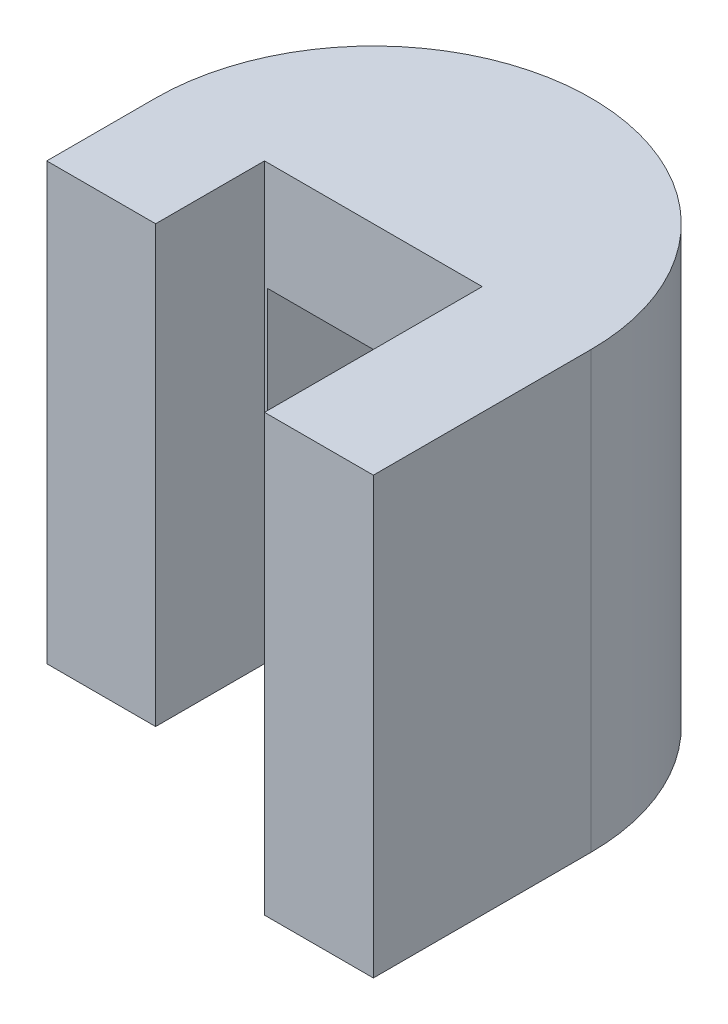
ISO-10303-21;
HEADER;
FILE_DESCRIPTION(('STEP AP214'),'2;1');
FILE_NAME('part.step','',(''),(''),'','','');
FILE_SCHEMA(('AUTOMOTIVE_DESIGN { 1 0 10303 214 1 1 1 1 }'));
ENDSEC;
DATA;
#1=APPLICATION_CONTEXT('core data for automotive mechanical design processes');
#2=APPLICATION_PROTOCOL_DEFINITION('international standard','automotive_design',2000,#1);
#3=PRODUCT_CONTEXT('',#1,'mechanical');
#4=PRODUCT('Part','Part','',(#3));
#5=PRODUCT_RELATED_PRODUCT_CATEGORY('part','',(#4));
#6=PRODUCT_DEFINITION_FORMATION('','',#4);
#7=PRODUCT_DEFINITION_CONTEXT('part definition',#1,'design');
#8=PRODUCT_DEFINITION('design','',#6,#7);
#9=PRODUCT_DEFINITION_SHAPE('','',#8);
#10=(LENGTH_UNIT() NAMED_UNIT(*) SI_UNIT(.MILLI.,.METRE.));
#11=(NAMED_UNIT(*) PLANE_ANGLE_UNIT() SI_UNIT($,.RADIAN.));
#12=(NAMED_UNIT(*) SI_UNIT($,.STERADIAN.) SOLID_ANGLE_UNIT());
#13=UNCERTAINTY_MEASURE_WITH_UNIT(LENGTH_MEASURE(1.E-05),#10,'distance_accuracy_value','');
#14=(GEOMETRIC_REPRESENTATION_CONTEXT(3) GLOBAL_UNCERTAINTY_ASSIGNED_CONTEXT((#13)) GLOBAL_UNIT_ASSIGNED_CONTEXT((#10,
#11,#12)) REPRESENTATION_CONTEXT('',''));
#15=CARTESIAN_POINT('',(0.,0.,0.));
#16=DIRECTION('',(0.,0.,1.));
#17=DIRECTION('',(1.,0.,0.));
#18=AXIS2_PLACEMENT_3D('',#15,#16,#17);
#19=CARTESIAN_POINT('',(0.,0.,20.));
#20=DIRECTION('',(0.,0.,-1.));
#21=DIRECTION('',(-1.,0.,0.));
#22=AXIS2_PLACEMENT_3D('',#19,#20,#21);
#23=PLANE('',#22);
#24=DIRECTION('',(0.,-1.,0.));
#25=VECTOR('',#24,1.);
#26=CARTESIAN_POINT('',(10.2822021129187,30.,20.));
#27=LINE('',#26,#25);
#28=CARTESIAN_POINT('',(10.2822021129187,30.,20.));
#29=VERTEX_POINT('',#28);
#30=CARTESIAN_POINT('',(10.2822021129187,10.,20.));
#31=VERTEX_POINT('',#30);
#32=EDGE_CURVE('E199',#29,#31,#27,.T.);
#33=ORIENTED_EDGE('',*,*,#32,.F.);
#34=DIRECTION('',(1.,0.,0.));
#35=VECTOR('',#34,1.);
#36=CARTESIAN_POINT('',(0.,30.,20.));
#37=LINE('',#36,#35);
#38=CARTESIAN_POINT('',(29.7177978870813,30.,20.));
#39=VERTEX_POINT('',#38);
#40=EDGE_CURVE('E206',#29,#39,#37,.T.);
#41=ORIENTED_EDGE('',*,*,#40,.T.);
#42=DIRECTION('',(0.,1.,0.));
#43=VECTOR('',#42,1.);
#44=CARTESIAN_POINT('',(29.7177978870813,30.,20.));
#45=LINE('',#44,#43);
#46=CARTESIAN_POINT('',(29.7177978870813,10.,20.));
#47=VERTEX_POINT('',#46);
#48=EDGE_CURVE('E201',#47,#39,#45,.T.);
#49=ORIENTED_EDGE('',*,*,#48,.F.);
#50=DIRECTION('',(1.,0.,0.));
#51=VECTOR('',#50,1.);
#52=CARTESIAN_POINT('',(0.,10.,20.));
#53=LINE('',#52,#51);
#54=EDGE_CURVE('E195',#31,#47,#53,.T.);
#55=ORIENTED_EDGE('',*,*,#54,.F.);
#56=EDGE_LOOP('',(#33,#41,#49,#55));
#57=FACE_BOUND('',#56,.T.);
#58=DIRECTION('',(-1.,0.,0.));
#59=VECTOR('',#58,1.);
#60=CARTESIAN_POINT('',(0.,40.,20.));
#61=LINE('',#60,#59);
#62=CARTESIAN_POINT('',(30.,40.,20.));
#63=VERTEX_POINT('',#62);
#64=CARTESIAN_POINT('',(10.,40.,20.));
#65=VERTEX_POINT('',#64);
#66=EDGE_CURVE('E243',#63,#65,#61,.T.);
#67=ORIENTED_EDGE('',*,*,#66,.T.);
#68=DIRECTION('',(0.,1.,0.));
#69=VECTOR('',#68,1.);
#70=CARTESIAN_POINT('',(10.,0.,20.));
#71=LINE('',#70,#69);
#72=CARTESIAN_POINT('',(10.,0.,20.));
#73=VERTEX_POINT('',#72);
#74=EDGE_CURVE('E260',#73,#65,#71,.T.);
#75=ORIENTED_EDGE('',*,*,#74,.F.);
#76=DIRECTION('',(-1.,0.,0.));
#77=VECTOR('',#76,1.);
#78=CARTESIAN_POINT('',(0.,0.,20.));
#79=LINE('',#78,#77);
#80=CARTESIAN_POINT('',(30.,0.,20.));
#81=VERTEX_POINT('',#80);
#82=EDGE_CURVE('E247',#81,#73,#79,.T.);
#83=ORIENTED_EDGE('',*,*,#82,.F.);
#84=DIRECTION('',(0.,1.,0.));
#85=VECTOR('',#84,1.);
#86=CARTESIAN_POINT('',(30.,0.,20.));
#87=LINE('',#86,#85);
#88=EDGE_CURVE('E263',#81,#63,#87,.T.);
#89=ORIENTED_EDGE('',*,*,#88,.T.);
#90=EDGE_LOOP('',(#67,#75,#83,#89));
#91=FACE_BOUND('',#90,.T.);
#92=ADVANCED_FACE('F105',(#57,#91),#23,.F.);
#93=CARTESIAN_POINT('',(20.,0.,20.));
#94=DIRECTION('',(0.,1.,0.));
#95=DIRECTION('',(0.,0.,1.));
#96=AXIS2_PLACEMENT_3D('',#93,#94,#95);
#97=CYLINDRICAL_SURFACE('',#96,20.);
#98=CARTESIAN_POINT('',(20.,30.,20.));
#99=DIRECTION('',(0.,-1.,0.));
#100=DIRECTION('',(0.,0.,-1.));
#101=AXIS2_PLACEMENT_3D('',#98,#99,#100);
#102=CIRCLE('',#101,20.);
#103=CARTESIAN_POINT('',(29.7177978870813,30.,2.51959942604754));
#104=VERTEX_POINT('',#103);
#105=CARTESIAN_POINT('',(10.2822021129187,30.,2.51959942604754));
#106=VERTEX_POINT('',#105);
#107=EDGE_CURVE('E288',#104,#106,#102,.F.);
#108=ORIENTED_EDGE('',*,*,#107,.T.);
#109=DIRECTION('',(0.,1.,0.));
#110=VECTOR('',#109,1.);
#111=CARTESIAN_POINT('',(10.2822021129187,0.,2.51959942604754));
#112=LINE('',#111,#110);
#113=CARTESIAN_POINT('',(10.2822021129187,10.,2.51959942604754));
#114=VERTEX_POINT('',#113);
#115=EDGE_CURVE('E12',#106,#114,#112,.F.);
#116=ORIENTED_EDGE('',*,*,#115,.T.);
#117=CARTESIAN_POINT('',(20.,10.,20.));
#118=DIRECTION('',(0.,1.,0.));
#119=DIRECTION('',(0.,0.,1.));
#120=AXIS2_PLACEMENT_3D('',#117,#118,#119);
#121=CIRCLE('',#120,20.);
#122=CARTESIAN_POINT('',(29.7177978870813,10.,2.51959942604754));
#123=VERTEX_POINT('',#122);
#124=EDGE_CURVE('E211',#114,#123,#121,.F.);
#125=ORIENTED_EDGE('',*,*,#124,.T.);
#126=DIRECTION('',(0.,1.,0.));
#127=VECTOR('',#126,1.);
#128=CARTESIAN_POINT('',(29.7177978870813,0.,2.51959942604754));
#129=LINE('',#128,#127);
#130=EDGE_CURVE('E113',#123,#104,#129,.T.);
#131=ORIENTED_EDGE('',*,*,#130,.T.);
#132=EDGE_LOOP('',(#108,#116,#125,#131));
#133=FACE_BOUND('',#132,.T.);
#134=CARTESIAN_POINT('',(20.,40.,20.));
#135=DIRECTION('',(0.,1.,0.));
#136=DIRECTION('',(0.,0.,1.));
#137=AXIS2_PLACEMENT_3D('',#134,#135,#136);
#138=CIRCLE('',#137,20.);
#139=CARTESIAN_POINT('',(40.,40.,20.));
#140=VERTEX_POINT('',#139);
#141=CARTESIAN_POINT('',(0.,40.,20.));
#142=VERTEX_POINT('',#141);
#143=EDGE_CURVE('E231',#140,#142,#138,.T.);
#144=ORIENTED_EDGE('',*,*,#143,.F.);
#145=DIRECTION('',(0.,1.,0.));
#146=VECTOR('',#145,1.);
#147=CARTESIAN_POINT('',(40.,0.,20.));
#148=LINE('',#147,#146);
#149=CARTESIAN_POINT('',(40.,0.,20.));
#150=VERTEX_POINT('',#149);
#151=EDGE_CURVE('E234',#150,#140,#148,.T.);
#152=ORIENTED_EDGE('',*,*,#151,.F.);
#153=CARTESIAN_POINT('',(20.,0.,20.));
#154=DIRECTION('',(0.,1.,0.));
#155=DIRECTION('',(0.,0.,1.));
#156=AXIS2_PLACEMENT_3D('',#153,#154,#155);
#157=CIRCLE('',#156,20.);
#158=CARTESIAN_POINT('',(0.,0.,20.));
#159=VERTEX_POINT('',#158);
#160=EDGE_CURVE('E232',#150,#159,#157,.T.);
#161=ORIENTED_EDGE('',*,*,#160,.T.);
#162=DIRECTION('',(0.,1.,0.));
#163=VECTOR('',#162,1.);
#164=CARTESIAN_POINT('',(0.,0.,20.));
#165=LINE('',#164,#163);
#166=EDGE_CURVE('E205',#159,#142,#165,.T.);
#167=ORIENTED_EDGE('',*,*,#166,.T.);
#168=EDGE_LOOP('',(#144,#152,#161,#167));
#169=FACE_BOUND('',#168,.T.);
#170=ADVANCED_FACE('F292',(#133,#169),#97,.T.);
#171=CARTESIAN_POINT('',(0.,0.,40.));
#172=DIRECTION('',(0.,1.,0.));
#173=DIRECTION('',(0.,0.,1.));
#174=AXIS2_PLACEMENT_3D('',#171,#172,#173);
#175=PLANE('',#174);
#176=DIRECTION('',(0.,0.,-1.));
#177=VECTOR('',#176,1.);
#178=CARTESIAN_POINT('',(0.,0.,40.));
#179=LINE('',#178,#177);
#180=CARTESIAN_POINT('',(0.,0.,30.));
#181=VERTEX_POINT('',#180);
#182=EDGE_CURVE('E284',#181,#159,#179,.T.);
#183=ORIENTED_EDGE('',*,*,#182,.T.);
#184=ORIENTED_EDGE('',*,*,#160,.F.);
#185=DIRECTION('',(0.,0.,-1.));
#186=VECTOR('',#185,1.);
#187=CARTESIAN_POINT('',(40.,0.,40.));
#188=LINE('',#187,#186);
#189=CARTESIAN_POINT('',(40.,0.,40.));
#190=VERTEX_POINT('',#189);
#191=EDGE_CURVE('E281',#190,#150,#188,.T.);
#192=ORIENTED_EDGE('',*,*,#191,.F.);
#193=DIRECTION('',(1.,0.,0.));
#194=VECTOR('',#193,1.);
#195=CARTESIAN_POINT('',(0.,0.,40.));
#196=LINE('',#195,#194);
#197=CARTESIAN_POINT('',(30.,0.,40.));
#198=VERTEX_POINT('',#197);
#199=EDGE_CURVE('E262',#198,#190,#196,.T.);
#200=ORIENTED_EDGE('',*,*,#199,.F.);
#201=DIRECTION('',(0.,0.,-1.));
#202=VECTOR('',#201,1.);
#203=CARTESIAN_POINT('',(30.,0.,0.));
#204=LINE('',#203,#202);
#205=EDGE_CURVE('E120',#198,#81,#204,.T.);
#206=ORIENTED_EDGE('',*,*,#205,.T.);
#207=ORIENTED_EDGE('',*,*,#82,.T.);
#208=DIRECTION('',(0.,0.,1.));
#209=VECTOR('',#208,1.);
#210=CARTESIAN_POINT('',(9.99999999999999,0.,0.));
#211=LINE('',#210,#209);
#212=CARTESIAN_POINT('',(10.,0.,30.));
#213=VERTEX_POINT('',#212);
#214=EDGE_CURVE('E239',#73,#213,#211,.T.);
#215=ORIENTED_EDGE('',*,*,#214,.T.);
#216=DIRECTION('',(-1.,0.,0.));
#217=VECTOR('',#216,1.);
#218=CARTESIAN_POINT('',(0.,0.,30.));
#219=LINE('',#218,#217);
#220=EDGE_CURVE('E242',#213,#181,#219,.T.);
#221=ORIENTED_EDGE('',*,*,#220,.T.);
#222=EDGE_LOOP('',(#183,#184,#192,#200,#206,#207,#215,#221));
#223=FACE_BOUND('',#222,.T.);
#224=ADVANCED_FACE('F316',(#223),#175,.F.);
#225=CARTESIAN_POINT('',(0.,40.,40.));
#226=DIRECTION('',(0.,-1.,0.));
#227=DIRECTION('',(0.,0.,-1.));
#228=AXIS2_PLACEMENT_3D('',#225,#226,#227);
#229=PLANE('',#228);
#230=ORIENTED_EDGE('',*,*,#143,.T.);
#231=DIRECTION('',(0.,0.,-1.));
#232=VECTOR('',#231,1.);
#233=CARTESIAN_POINT('',(0.,40.,40.));
#234=LINE('',#233,#232);
#235=CARTESIAN_POINT('',(0.,40.,30.));
#236=VERTEX_POINT('',#235);
#237=EDGE_CURVE('E275',#236,#142,#234,.T.);
#238=ORIENTED_EDGE('',*,*,#237,.F.);
#239=DIRECTION('',(-1.,0.,0.));
#240=VECTOR('',#239,1.);
#241=CARTESIAN_POINT('',(0.,40.,30.));
#242=LINE('',#241,#240);
#243=CARTESIAN_POINT('',(10.,40.,30.));
#244=VERTEX_POINT('',#243);
#245=EDGE_CURVE('E253',#244,#236,#242,.T.);
#246=ORIENTED_EDGE('',*,*,#245,.F.);
#247=DIRECTION('',(0.,0.,1.));
#248=VECTOR('',#247,1.);
#249=CARTESIAN_POINT('',(9.99999999999999,40.,0.));
#250=LINE('',#249,#248);
#251=EDGE_CURVE('E238',#65,#244,#250,.T.);
#252=ORIENTED_EDGE('',*,*,#251,.F.);
#253=ORIENTED_EDGE('',*,*,#66,.F.);
#254=DIRECTION('',(0.,0.,-1.));
#255=VECTOR('',#254,1.);
#256=CARTESIAN_POINT('',(30.,40.,0.));
#257=LINE('',#256,#255);
#258=CARTESIAN_POINT('',(30.,40.,40.));
#259=VERTEX_POINT('',#258);
#260=EDGE_CURVE('E255',#259,#63,#257,.T.);
#261=ORIENTED_EDGE('',*,*,#260,.F.);
#262=DIRECTION('',(-1.,0.,0.));
#263=VECTOR('',#262,1.);
#264=CARTESIAN_POINT('',(0.,40.,40.));
#265=LINE('',#264,#263);
#266=CARTESIAN_POINT('',(40.,40.,40.));
#267=VERTEX_POINT('',#266);
#268=EDGE_CURVE('E273',#267,#259,#265,.T.);
#269=ORIENTED_EDGE('',*,*,#268,.F.);
#270=DIRECTION('',(0.,0.,-1.));
#271=VECTOR('',#270,1.);
#272=CARTESIAN_POINT('',(40.,40.,40.));
#273=LINE('',#272,#271);
#274=EDGE_CURVE('E278',#267,#140,#273,.T.);
#275=ORIENTED_EDGE('',*,*,#274,.T.);
#276=EDGE_LOOP('',(#230,#238,#246,#252,#253,#261,#269,#275));
#277=FACE_BOUND('',#276,.T.);
#278=ADVANCED_FACE('F328',(#277),#229,.F.);
#279=CARTESIAN_POINT('',(0.,0.,40.));
#280=DIRECTION('',(1.,0.,0.));
#281=DIRECTION('',(0.,0.,-1.));
#282=AXIS2_PLACEMENT_3D('',#279,#280,#281);
#283=PLANE('',#282);
#284=ORIENTED_EDGE('',*,*,#237,.T.);
#285=ORIENTED_EDGE('',*,*,#166,.F.);
#286=ORIENTED_EDGE('',*,*,#182,.F.);
#287=DIRECTION('',(0.,1.,0.));
#288=VECTOR('',#287,1.);
#289=CARTESIAN_POINT('',(0.,0.,30.));
#290=LINE('',#289,#288);
#291=EDGE_CURVE('E267',#181,#236,#290,.T.);
#292=ORIENTED_EDGE('',*,*,#291,.T.);
#293=EDGE_LOOP('',(#284,#285,#286,#292));
#294=FACE_BOUND('',#293,.T.);
#295=ADVANCED_FACE('F107',(#294),#283,.F.);
#296=CARTESIAN_POINT('',(40.,0.,40.));
#297=DIRECTION('',(-1.,0.,0.));
#298=DIRECTION('',(0.,0.,1.));
#299=AXIS2_PLACEMENT_3D('',#296,#297,#298);
#300=PLANE('',#299);
#301=ORIENTED_EDGE('',*,*,#191,.T.);
#302=ORIENTED_EDGE('',*,*,#151,.T.);
#303=ORIENTED_EDGE('',*,*,#274,.F.);
#304=DIRECTION('',(0.,1.,0.));
#305=VECTOR('',#304,1.);
#306=CARTESIAN_POINT('',(40.,0.,40.));
#307=LINE('',#306,#305);
#308=EDGE_CURVE('E128',#190,#267,#307,.T.);
#309=ORIENTED_EDGE('',*,*,#308,.F.);
#310=EDGE_LOOP('',(#301,#302,#303,#309));
#311=FACE_BOUND('',#310,.T.);
#312=ADVANCED_FACE('F327',(#311),#300,.F.);
#313=CARTESIAN_POINT('',(0.,0.,40.));
#314=DIRECTION('',(0.,0.,-1.));
#315=DIRECTION('',(-1.,0.,0.));
#316=AXIS2_PLACEMENT_3D('',#313,#314,#315);
#317=PLANE('',#316);
#318=ORIENTED_EDGE('',*,*,#268,.T.);
#319=DIRECTION('',(0.,1.,0.));
#320=VECTOR('',#319,1.);
#321=CARTESIAN_POINT('',(30.,0.,40.));
#322=LINE('',#321,#320);
#323=EDGE_CURVE('E265',#198,#259,#322,.T.);
#324=ORIENTED_EDGE('',*,*,#323,.F.);
#325=ORIENTED_EDGE('',*,*,#199,.T.);
#326=ORIENTED_EDGE('',*,*,#308,.T.);
#327=EDGE_LOOP('',(#318,#324,#325,#326));
#328=FACE_BOUND('',#327,.T.);
#329=ADVANCED_FACE('F323',(#328),#317,.F.);
#330=CARTESIAN_POINT('',(9.99999999999999,0.,0.));
#331=DIRECTION('',(-1.,0.,0.));
#332=DIRECTION('',(0.,0.,1.));
#333=AXIS2_PLACEMENT_3D('',#330,#331,#332);
#334=PLANE('',#333);
#335=ORIENTED_EDGE('',*,*,#251,.T.);
#336=DIRECTION('',(0.,1.,0.));
#337=VECTOR('',#336,1.);
#338=CARTESIAN_POINT('',(10.,0.,30.));
#339=LINE('',#338,#337);
#340=EDGE_CURVE('E250',#213,#244,#339,.T.);
#341=ORIENTED_EDGE('',*,*,#340,.F.);
#342=ORIENTED_EDGE('',*,*,#214,.F.);
#343=ORIENTED_EDGE('',*,*,#74,.T.);
#344=EDGE_LOOP('',(#335,#341,#342,#343));
#345=FACE_BOUND('',#344,.T.);
#346=ADVANCED_FACE('F319',(#345),#334,.F.);
#347=CARTESIAN_POINT('',(30.,0.,0.));
#348=DIRECTION('',(1.,0.,0.));
#349=DIRECTION('',(0.,0.,-1.));
#350=AXIS2_PLACEMENT_3D('',#347,#348,#349);
#351=PLANE('',#350);
#352=ORIENTED_EDGE('',*,*,#260,.T.);
#353=ORIENTED_EDGE('',*,*,#88,.F.);
#354=ORIENTED_EDGE('',*,*,#205,.F.);
#355=ORIENTED_EDGE('',*,*,#323,.T.);
#356=EDGE_LOOP('',(#352,#353,#354,#355));
#357=FACE_BOUND('',#356,.T.);
#358=ADVANCED_FACE('F307',(#357),#351,.F.);
#359=CARTESIAN_POINT('',(0.,0.,30.));
#360=DIRECTION('',(0.,0.,-1.));
#361=DIRECTION('',(-1.,0.,0.));
#362=AXIS2_PLACEMENT_3D('',#359,#360,#361);
#363=PLANE('',#362);
#364=ORIENTED_EDGE('',*,*,#245,.T.);
#365=ORIENTED_EDGE('',*,*,#291,.F.);
#366=ORIENTED_EDGE('',*,*,#220,.F.);
#367=ORIENTED_EDGE('',*,*,#340,.T.);
#368=EDGE_LOOP('',(#364,#365,#366,#367));
#369=FACE_BOUND('',#368,.T.);
#370=ADVANCED_FACE('F300',(#369),#363,.F.);
#371=CARTESIAN_POINT('',(40.,30.,0.));
#372=DIRECTION('',(0.,-1.,0.));
#373=DIRECTION('',(0.,0.,-1.));
#374=AXIS2_PLACEMENT_3D('',#371,#372,#373);
#375=PLANE('',#374);
#376=ORIENTED_EDGE('',*,*,#107,.F.);
#377=DIRECTION('',(0.,0.,-1.));
#378=VECTOR('',#377,1.);
#379=CARTESIAN_POINT('',(29.7177978870813,30.,2.));
#380=LINE('',#379,#378);
#381=EDGE_CURVE('E225',#39,#104,#380,.T.);
#382=ORIENTED_EDGE('',*,*,#381,.F.);
#383=ORIENTED_EDGE('',*,*,#40,.F.);
#384=DIRECTION('',(0.,0.,1.));
#385=VECTOR('',#384,1.);
#386=CARTESIAN_POINT('',(10.2822021129187,30.,20.));
#387=LINE('',#386,#385);
#388=EDGE_CURVE('E214',#106,#29,#387,.T.);
#389=ORIENTED_EDGE('',*,*,#388,.F.);
#390=EDGE_LOOP('',(#376,#382,#383,#389));
#391=FACE_BOUND('',#390,.T.);
#392=ADVANCED_FACE('F298',(#391),#375,.T.);
#393=CARTESIAN_POINT('',(40.,10.,0.));
#394=DIRECTION('',(0.,1.,0.));
#395=DIRECTION('',(0.,0.,1.));
#396=AXIS2_PLACEMENT_3D('',#393,#394,#395);
#397=PLANE('',#396);
#398=ORIENTED_EDGE('',*,*,#124,.F.);
#399=DIRECTION('',(0.,0.,-1.));
#400=VECTOR('',#399,1.);
#401=CARTESIAN_POINT('',(10.2822021129187,10.,20.));
#402=LINE('',#401,#400);
#403=EDGE_CURVE('E209',#31,#114,#402,.T.);
#404=ORIENTED_EDGE('',*,*,#403,.F.);
#405=ORIENTED_EDGE('',*,*,#54,.T.);
#406=DIRECTION('',(0.,0.,1.));
#407=VECTOR('',#406,1.);
#408=CARTESIAN_POINT('',(29.7177978870813,10.,2.));
#409=LINE('',#408,#407);
#410=EDGE_CURVE('E222',#123,#47,#409,.T.);
#411=ORIENTED_EDGE('',*,*,#410,.F.);
#412=EDGE_LOOP('',(#398,#404,#405,#411));
#413=FACE_BOUND('',#412,.T.);
#414=ADVANCED_FACE('F210',(#413),#397,.T.);
#415=CARTESIAN_POINT('',(29.7177978870813,0.,0.));
#416=DIRECTION('',(-1.,0.,0.));
#417=DIRECTION('',(0.,0.,1.));
#418=AXIS2_PLACEMENT_3D('',#415,#416,#417);
#419=PLANE('',#418);
#420=ORIENTED_EDGE('',*,*,#410,.T.);
#421=ORIENTED_EDGE('',*,*,#48,.T.);
#422=ORIENTED_EDGE('',*,*,#381,.T.);
#423=ORIENTED_EDGE('',*,*,#130,.F.);
#424=EDGE_LOOP('',(#420,#421,#422,#423));
#425=FACE_BOUND('',#424,.T.);
#426=ADVANCED_FACE('F295',(#425),#419,.T.);
#427=CARTESIAN_POINT('',(10.2822021129187,0.,0.));
#428=DIRECTION('',(1.,0.,0.));
#429=DIRECTION('',(0.,0.,-1.));
#430=AXIS2_PLACEMENT_3D('',#427,#428,#429);
#431=PLANE('',#430);
#432=ORIENTED_EDGE('',*,*,#388,.T.);
#433=ORIENTED_EDGE('',*,*,#32,.T.);
#434=ORIENTED_EDGE('',*,*,#403,.T.);
#435=ORIENTED_EDGE('',*,*,#115,.F.);
#436=EDGE_LOOP('',(#432,#433,#434,#435));
#437=FACE_BOUND('',#436,.T.);
#438=ADVANCED_FACE('F217',(#437),#431,.T.);
#439=CLOSED_SHELL('',(#92,#170,#224,#278,#295,#312,#329,#346,#358,#370,#392,#414,#426,#438));
#440=MANIFOLD_SOLID_BREP('B2',#439);
#441=ADVANCED_BREP_SHAPE_REPRESENTATION('',(#18,#440),#14);
#442=SHAPE_DEFINITION_REPRESENTATION(#9,#441);
ENDSEC;
END-ISO-10303-21;
